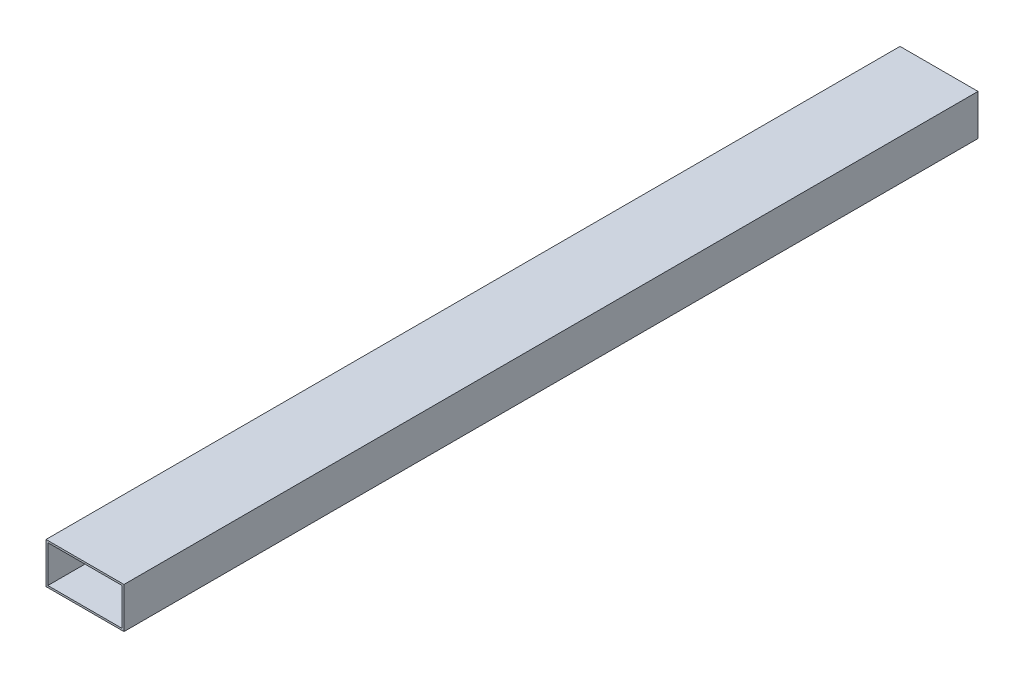
ISO-10303-21;
HEADER;
FILE_DESCRIPTION(('STEP AP214'),'2;1');
FILE_NAME('part.step','',(''),(''),'','','');
FILE_SCHEMA(('AUTOMOTIVE_DESIGN { 1 0 10303 214 1 1 1 1 }'));
ENDSEC;
DATA;
#1=APPLICATION_CONTEXT('core data for automotive mechanical design processes');
#2=APPLICATION_PROTOCOL_DEFINITION('international standard','automotive_design',2000,#1);
#3=PRODUCT_CONTEXT('',#1,'mechanical');
#4=PRODUCT('Part','Part','',(#3));
#5=PRODUCT_RELATED_PRODUCT_CATEGORY('part','',(#4));
#6=PRODUCT_DEFINITION_FORMATION('','',#4);
#7=PRODUCT_DEFINITION_CONTEXT('part definition',#1,'design');
#8=PRODUCT_DEFINITION('design','',#6,#7);
#9=PRODUCT_DEFINITION_SHAPE('','',#8);
#10=(LENGTH_UNIT() NAMED_UNIT(*) SI_UNIT(.MILLI.,.METRE.));
#11=(NAMED_UNIT(*) PLANE_ANGLE_UNIT() SI_UNIT($,.RADIAN.));
#12=(NAMED_UNIT(*) SI_UNIT($,.STERADIAN.) SOLID_ANGLE_UNIT());
#13=UNCERTAINTY_MEASURE_WITH_UNIT(LENGTH_MEASURE(1.E-05),#10,'distance_accuracy_value','');
#14=(GEOMETRIC_REPRESENTATION_CONTEXT(3) GLOBAL_UNCERTAINTY_ASSIGNED_CONTEXT((#13)) GLOBAL_UNIT_ASSIGNED_CONTEXT((#10,
#11,#12)) REPRESENTATION_CONTEXT('',''));
#15=CARTESIAN_POINT('',(0.,0.,0.));
#16=DIRECTION('',(0.,0.,1.));
#17=DIRECTION('',(1.,0.,0.));
#18=AXIS2_PLACEMENT_3D('',#15,#16,#17);
#19=CARTESIAN_POINT('',(0.,0.,460.));
#20=DIRECTION('',(0.,0.,1.));
#21=DIRECTION('',(1.,0.,0.));
#22=AXIS2_PLACEMENT_3D('',#19,#20,#21);
#23=PLANE('',#22);
#24=DIRECTION('',(0.,1.,0.));
#25=VECTOR('',#24,1.);
#26=CARTESIAN_POINT('',(21.,-11.,460.));
#27=LINE('',#26,#25);
#28=CARTESIAN_POINT('',(21.,-11.,460.));
#29=VERTEX_POINT('',#28);
#30=CARTESIAN_POINT('',(21.,11.,460.));
#31=VERTEX_POINT('',#30);
#32=EDGE_CURVE('E137',#29,#31,#27,.T.);
#33=ORIENTED_EDGE('',*,*,#32,.T.);
#34=DIRECTION('',(-1.,0.,0.));
#35=VECTOR('',#34,1.);
#36=CARTESIAN_POINT('',(21.,11.,460.));
#37=LINE('',#36,#35);
#38=CARTESIAN_POINT('',(-21.,11.,460.));
#39=VERTEX_POINT('',#38);
#40=EDGE_CURVE('E140',#31,#39,#37,.T.);
#41=ORIENTED_EDGE('',*,*,#40,.T.);
#42=DIRECTION('',(0.,-1.,0.));
#43=VECTOR('',#42,1.);
#44=CARTESIAN_POINT('',(-21.,-11.,460.));
#45=LINE('',#44,#43);
#46=CARTESIAN_POINT('',(-21.,-11.,460.));
#47=VERTEX_POINT('',#46);
#48=EDGE_CURVE('E143',#39,#47,#45,.T.);
#49=ORIENTED_EDGE('',*,*,#48,.T.);
#50=DIRECTION('',(1.,0.,0.));
#51=VECTOR('',#50,1.);
#52=CARTESIAN_POINT('',(21.,-11.,460.));
#53=LINE('',#52,#51);
#54=EDGE_CURVE('E145',#47,#29,#53,.T.);
#55=ORIENTED_EDGE('',*,*,#54,.T.);
#56=EDGE_LOOP('',(#33,#41,#49,#55));
#57=FACE_BOUND('',#56,.T.);
#58=DIRECTION('',(1.,0.,0.));
#59=VECTOR('',#58,1.);
#60=CARTESIAN_POINT('',(20.,-10.,460.));
#61=LINE('',#60,#59);
#62=CARTESIAN_POINT('',(-20.,-10.,460.));
#63=VERTEX_POINT('',#62);
#64=CARTESIAN_POINT('',(20.,-10.,460.));
#65=VERTEX_POINT('',#64);
#66=EDGE_CURVE('E109',#63,#65,#61,.T.);
#67=ORIENTED_EDGE('',*,*,#66,.F.);
#68=DIRECTION('',(0.,-1.,0.));
#69=VECTOR('',#68,1.);
#70=CARTESIAN_POINT('',(-20.,-10.,460.));
#71=LINE('',#70,#69);
#72=CARTESIAN_POINT('',(-20.,10.,460.));
#73=VERTEX_POINT('',#72);
#74=EDGE_CURVE('E101',#73,#63,#71,.T.);
#75=ORIENTED_EDGE('',*,*,#74,.F.);
#76=DIRECTION('',(-1.,0.,0.));
#77=VECTOR('',#76,1.);
#78=CARTESIAN_POINT('',(20.,10.,460.));
#79=LINE('',#78,#77);
#80=CARTESIAN_POINT('',(20.,10.,460.));
#81=VERTEX_POINT('',#80);
#82=EDGE_CURVE('E123',#81,#73,#79,.T.);
#83=ORIENTED_EDGE('',*,*,#82,.F.);
#84=DIRECTION('',(0.,1.,0.));
#85=VECTOR('',#84,1.);
#86=CARTESIAN_POINT('',(20.,-10.,460.));
#87=LINE('',#86,#85);
#88=EDGE_CURVE('E121',#65,#81,#87,.T.);
#89=ORIENTED_EDGE('',*,*,#88,.F.);
#90=EDGE_LOOP('',(#67,#75,#83,#89));
#91=FACE_BOUND('',#90,.T.);
#92=ADVANCED_FACE('F36',(#57,#91),#23,.T.);
#93=CARTESIAN_POINT('',(0.,0.,0.));
#94=DIRECTION('',(0.,0.,1.));
#95=DIRECTION('',(1.,0.,0.));
#96=AXIS2_PLACEMENT_3D('',#93,#94,#95);
#97=PLANE('',#96);
#98=DIRECTION('',(0.,1.,0.));
#99=VECTOR('',#98,1.);
#100=CARTESIAN_POINT('',(21.,-11.,0.));
#101=LINE('',#100,#99);
#102=CARTESIAN_POINT('',(21.,-11.,0.));
#103=VERTEX_POINT('',#102);
#104=CARTESIAN_POINT('',(21.,11.,0.));
#105=VERTEX_POINT('',#104);
#106=EDGE_CURVE('E117',#103,#105,#101,.T.);
#107=ORIENTED_EDGE('',*,*,#106,.F.);
#108=DIRECTION('',(1.,0.,0.));
#109=VECTOR('',#108,1.);
#110=CARTESIAN_POINT('',(21.,-11.,0.));
#111=LINE('',#110,#109);
#112=CARTESIAN_POINT('',(-21.,-11.,0.));
#113=VERTEX_POINT('',#112);
#114=EDGE_CURVE('E141',#113,#103,#111,.T.);
#115=ORIENTED_EDGE('',*,*,#114,.F.);
#116=DIRECTION('',(0.,-1.,0.));
#117=VECTOR('',#116,1.);
#118=CARTESIAN_POINT('',(-21.,-11.,0.));
#119=LINE('',#118,#117);
#120=CARTESIAN_POINT('',(-21.,11.,0.));
#121=VERTEX_POINT('',#120);
#122=EDGE_CURVE('E152',#121,#113,#119,.T.);
#123=ORIENTED_EDGE('',*,*,#122,.F.);
#124=DIRECTION('',(-1.,0.,0.));
#125=VECTOR('',#124,1.);
#126=CARTESIAN_POINT('',(21.,11.,0.));
#127=LINE('',#126,#125);
#128=EDGE_CURVE('E150',#105,#121,#127,.T.);
#129=ORIENTED_EDGE('',*,*,#128,.F.);
#130=EDGE_LOOP('',(#107,#115,#123,#129));
#131=FACE_BOUND('',#130,.T.);
#132=DIRECTION('',(0.,-1.,0.));
#133=VECTOR('',#132,1.);
#134=CARTESIAN_POINT('',(-20.,-10.,0.));
#135=LINE('',#134,#133);
#136=CARTESIAN_POINT('',(-20.,10.,0.));
#137=VERTEX_POINT('',#136);
#138=CARTESIAN_POINT('',(-20.,-10.,0.));
#139=VERTEX_POINT('',#138);
#140=EDGE_CURVE('E59',#137,#139,#135,.T.);
#141=ORIENTED_EDGE('',*,*,#140,.T.);
#142=DIRECTION('',(1.,0.,0.));
#143=VECTOR('',#142,1.);
#144=CARTESIAN_POINT('',(20.,-10.,0.));
#145=LINE('',#144,#143);
#146=CARTESIAN_POINT('',(20.,-10.,0.));
#147=VERTEX_POINT('',#146);
#148=EDGE_CURVE('E116',#139,#147,#145,.T.);
#149=ORIENTED_EDGE('',*,*,#148,.T.);
#150=DIRECTION('',(0.,1.,0.));
#151=VECTOR('',#150,1.);
#152=CARTESIAN_POINT('',(20.,-10.,0.));
#153=LINE('',#152,#151);
#154=CARTESIAN_POINT('',(20.,10.,0.));
#155=VERTEX_POINT('',#154);
#156=EDGE_CURVE('E129',#147,#155,#153,.T.);
#157=ORIENTED_EDGE('',*,*,#156,.T.);
#158=DIRECTION('',(-1.,0.,0.));
#159=VECTOR('',#158,1.);
#160=CARTESIAN_POINT('',(20.,10.,0.));
#161=LINE('',#160,#159);
#162=EDGE_CURVE('E110',#155,#137,#161,.T.);
#163=ORIENTED_EDGE('',*,*,#162,.T.);
#164=EDGE_LOOP('',(#141,#149,#157,#163));
#165=FACE_BOUND('',#164,.T.);
#166=ADVANCED_FACE('F170',(#131,#165),#97,.F.);
#167=CARTESIAN_POINT('',(21.,-11.,460.));
#168=DIRECTION('',(-1.,0.,0.));
#169=DIRECTION('',(0.,0.,1.));
#170=AXIS2_PLACEMENT_3D('',#167,#168,#169);
#171=PLANE('',#170);
#172=ORIENTED_EDGE('',*,*,#106,.T.);
#173=DIRECTION('',(0.,0.,-1.));
#174=VECTOR('',#173,1.);
#175=CARTESIAN_POINT('',(21.,11.,460.));
#176=LINE('',#175,#174);
#177=EDGE_CURVE('E11',#31,#105,#176,.T.);
#178=ORIENTED_EDGE('',*,*,#177,.F.);
#179=ORIENTED_EDGE('',*,*,#32,.F.);
#180=DIRECTION('',(0.,0.,-1.));
#181=VECTOR('',#180,1.);
#182=CARTESIAN_POINT('',(21.,-11.,460.));
#183=LINE('',#182,#181);
#184=EDGE_CURVE('E147',#29,#103,#183,.T.);
#185=ORIENTED_EDGE('',*,*,#184,.T.);
#186=EDGE_LOOP('',(#172,#178,#179,#185));
#187=FACE_BOUND('',#186,.T.);
#188=ADVANCED_FACE('F38',(#187),#171,.F.);
#189=CARTESIAN_POINT('',(21.,11.,460.));
#190=DIRECTION('',(0.,-1.,0.));
#191=DIRECTION('',(1.,0.,0.));
#192=AXIS2_PLACEMENT_3D('',#189,#190,#191);
#193=PLANE('',#192);
#194=ORIENTED_EDGE('',*,*,#128,.T.);
#195=DIRECTION('',(0.,0.,-1.));
#196=VECTOR('',#195,1.);
#197=CARTESIAN_POINT('',(-21.,11.,460.));
#198=LINE('',#197,#196);
#199=EDGE_CURVE('E44',#39,#121,#198,.T.);
#200=ORIENTED_EDGE('',*,*,#199,.F.);
#201=ORIENTED_EDGE('',*,*,#40,.F.);
#202=ORIENTED_EDGE('',*,*,#177,.T.);
#203=EDGE_LOOP('',(#194,#200,#201,#202));
#204=FACE_BOUND('',#203,.T.);
#205=ADVANCED_FACE('F180',(#204),#193,.F.);
#206=CARTESIAN_POINT('',(-21.,-11.,460.));
#207=DIRECTION('',(1.,0.,0.));
#208=DIRECTION('',(0.,0.,-1.));
#209=AXIS2_PLACEMENT_3D('',#206,#207,#208);
#210=PLANE('',#209);
#211=ORIENTED_EDGE('',*,*,#122,.T.);
#212=DIRECTION('',(0.,0.,-1.));
#213=VECTOR('',#212,1.);
#214=CARTESIAN_POINT('',(-21.,-11.,460.));
#215=LINE('',#214,#213);
#216=EDGE_CURVE('E157',#47,#113,#215,.T.);
#217=ORIENTED_EDGE('',*,*,#216,.F.);
#218=ORIENTED_EDGE('',*,*,#48,.F.);
#219=ORIENTED_EDGE('',*,*,#199,.T.);
#220=EDGE_LOOP('',(#211,#217,#218,#219));
#221=FACE_BOUND('',#220,.T.);
#222=ADVANCED_FACE('F164',(#221),#210,.F.);
#223=CARTESIAN_POINT('',(21.,-11.,460.));
#224=DIRECTION('',(0.,1.,0.));
#225=DIRECTION('',(-1.,0.,0.));
#226=AXIS2_PLACEMENT_3D('',#223,#224,#225);
#227=PLANE('',#226);
#228=ORIENTED_EDGE('',*,*,#114,.T.);
#229=ORIENTED_EDGE('',*,*,#184,.F.);
#230=ORIENTED_EDGE('',*,*,#54,.F.);
#231=ORIENTED_EDGE('',*,*,#216,.T.);
#232=EDGE_LOOP('',(#228,#229,#230,#231));
#233=FACE_BOUND('',#232,.T.);
#234=ADVANCED_FACE('F174',(#233),#227,.F.);
#235=CARTESIAN_POINT('',(-20.,-10.,460.));
#236=DIRECTION('',(1.,0.,0.));
#237=DIRECTION('',(0.,0.,-1.));
#238=AXIS2_PLACEMENT_3D('',#235,#236,#237);
#239=PLANE('',#238);
#240=ORIENTED_EDGE('',*,*,#140,.F.);
#241=DIRECTION('',(0.,0.,-1.));
#242=VECTOR('',#241,1.);
#243=CARTESIAN_POINT('',(-20.,10.,460.));
#244=LINE('',#243,#242);
#245=EDGE_CURVE('E105',#73,#137,#244,.T.);
#246=ORIENTED_EDGE('',*,*,#245,.F.);
#247=ORIENTED_EDGE('',*,*,#74,.T.);
#248=DIRECTION('',(0.,0.,-1.));
#249=VECTOR('',#248,1.);
#250=CARTESIAN_POINT('',(-20.,-10.,460.));
#251=LINE('',#250,#249);
#252=EDGE_CURVE('E104',#63,#139,#251,.T.);
#253=ORIENTED_EDGE('',*,*,#252,.T.);
#254=EDGE_LOOP('',(#240,#246,#247,#253));
#255=FACE_BOUND('',#254,.T.);
#256=ADVANCED_FACE('F103',(#255),#239,.T.);
#257=CARTESIAN_POINT('',(20.,-10.,460.));
#258=DIRECTION('',(0.,1.,0.));
#259=DIRECTION('',(-1.,0.,0.));
#260=AXIS2_PLACEMENT_3D('',#257,#258,#259);
#261=PLANE('',#260);
#262=ORIENTED_EDGE('',*,*,#148,.F.);
#263=ORIENTED_EDGE('',*,*,#252,.F.);
#264=ORIENTED_EDGE('',*,*,#66,.T.);
#265=DIRECTION('',(0.,0.,-1.));
#266=VECTOR('',#265,1.);
#267=CARTESIAN_POINT('',(20.,-10.,460.));
#268=LINE('',#267,#266);
#269=EDGE_CURVE('E118',#65,#147,#268,.T.);
#270=ORIENTED_EDGE('',*,*,#269,.T.);
#271=EDGE_LOOP('',(#262,#263,#264,#270));
#272=FACE_BOUND('',#271,.T.);
#273=ADVANCED_FACE('F113',(#272),#261,.T.);
#274=CARTESIAN_POINT('',(20.,-10.,460.));
#275=DIRECTION('',(-1.,0.,0.));
#276=DIRECTION('',(0.,0.,1.));
#277=AXIS2_PLACEMENT_3D('',#274,#275,#276);
#278=PLANE('',#277);
#279=ORIENTED_EDGE('',*,*,#156,.F.);
#280=ORIENTED_EDGE('',*,*,#269,.F.);
#281=ORIENTED_EDGE('',*,*,#88,.T.);
#282=DIRECTION('',(0.,0.,-1.));
#283=VECTOR('',#282,1.);
#284=CARTESIAN_POINT('',(20.,10.,460.));
#285=LINE('',#284,#283);
#286=EDGE_CURVE('E51',#81,#155,#285,.T.);
#287=ORIENTED_EDGE('',*,*,#286,.T.);
#288=EDGE_LOOP('',(#279,#280,#281,#287));
#289=FACE_BOUND('',#288,.T.);
#290=ADVANCED_FACE('F203',(#289),#278,.T.);
#291=CARTESIAN_POINT('',(20.,10.,460.));
#292=DIRECTION('',(0.,-1.,0.));
#293=DIRECTION('',(1.,0.,0.));
#294=AXIS2_PLACEMENT_3D('',#291,#292,#293);
#295=PLANE('',#294);
#296=ORIENTED_EDGE('',*,*,#162,.F.);
#297=ORIENTED_EDGE('',*,*,#286,.F.);
#298=ORIENTED_EDGE('',*,*,#82,.T.);
#299=ORIENTED_EDGE('',*,*,#245,.T.);
#300=EDGE_LOOP('',(#296,#297,#298,#299));
#301=FACE_BOUND('',#300,.T.);
#302=ADVANCED_FACE('F207',(#301),#295,.T.);
#303=CLOSED_SHELL('',(#92,#166,#188,#205,#222,#234,#256,#273,#290,#302));
#304=MANIFOLD_SOLID_BREP('B2',#303);
#305=ADVANCED_BREP_SHAPE_REPRESENTATION('',(#18,#304),#14);
#306=SHAPE_DEFINITION_REPRESENTATION(#9,#305);
ENDSEC;
END-ISO-10303-21;
